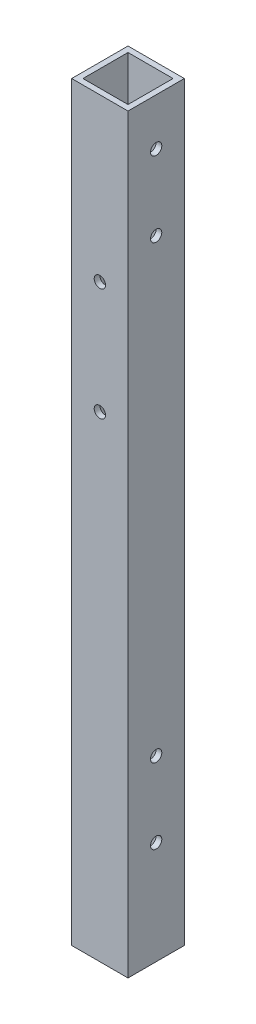
ISO-10303-21;
HEADER;
FILE_DESCRIPTION(('STEP AP214'),'2;1');
FILE_NAME('part.step','',(''),(''),'','','');
FILE_SCHEMA(('AUTOMOTIVE_DESIGN { 1 0 10303 214 1 1 1 1 }'));
ENDSEC;
DATA;
#1=APPLICATION_CONTEXT('core data for automotive mechanical design processes');
#2=APPLICATION_PROTOCOL_DEFINITION('international standard','automotive_design',2000,#1);
#3=PRODUCT_CONTEXT('',#1,'mechanical');
#4=PRODUCT('Part','Part','',(#3));
#5=PRODUCT_RELATED_PRODUCT_CATEGORY('part','',(#4));
#6=PRODUCT_DEFINITION_FORMATION('','',#4);
#7=PRODUCT_DEFINITION_CONTEXT('part definition',#1,'design');
#8=PRODUCT_DEFINITION('design','',#6,#7);
#9=PRODUCT_DEFINITION_SHAPE('','',#8);
#10=(LENGTH_UNIT() NAMED_UNIT(*) SI_UNIT(.MILLI.,.METRE.));
#11=(NAMED_UNIT(*) PLANE_ANGLE_UNIT() SI_UNIT($,.RADIAN.));
#12=(NAMED_UNIT(*) SI_UNIT($,.STERADIAN.) SOLID_ANGLE_UNIT());
#13=UNCERTAINTY_MEASURE_WITH_UNIT(LENGTH_MEASURE(1.E-05),#10,'distance_accuracy_value','');
#14=(GEOMETRIC_REPRESENTATION_CONTEXT(3) GLOBAL_UNCERTAINTY_ASSIGNED_CONTEXT((#13)) GLOBAL_UNIT_ASSIGNED_CONTEXT((#10,
#11,#12)) REPRESENTATION_CONTEXT('',''));
#15=CARTESIAN_POINT('',(0.,0.,0.));
#16=DIRECTION('',(0.,0.,1.));
#17=DIRECTION('',(1.,0.,0.));
#18=AXIS2_PLACEMENT_3D('',#15,#16,#17);
#19=CARTESIAN_POINT('',(0.,200.,0.));
#20=DIRECTION('',(0.,1.,0.));
#21=DIRECTION('',(0.,0.,1.));
#22=AXIS2_PLACEMENT_3D('',#19,#20,#21);
#23=PLANE('',#22);
#24=DIRECTION('',(0.,0.,1.));
#25=VECTOR('',#24,1.);
#26=CARTESIAN_POINT('',(0.,200.,0.));
#27=LINE('',#26,#25);
#28=CARTESIAN_POINT('',(0.,200.,-15.));
#29=VERTEX_POINT('',#28);
#30=CARTESIAN_POINT('',(0.,200.,0.));
#31=VERTEX_POINT('',#30);
#32=EDGE_CURVE('E169',#29,#31,#27,.T.);
#33=ORIENTED_EDGE('',*,*,#32,.T.);
#34=DIRECTION('',(1.,0.,0.));
#35=VECTOR('',#34,1.);
#36=CARTESIAN_POINT('',(0.,200.,0.));
#37=LINE('',#36,#35);
#38=CARTESIAN_POINT('',(15.,200.,0.));
#39=VERTEX_POINT('',#38);
#40=EDGE_CURVE('E172',#31,#39,#37,.T.);
#41=ORIENTED_EDGE('',*,*,#40,.T.);
#42=DIRECTION('',(0.,0.,-1.));
#43=VECTOR('',#42,1.);
#44=CARTESIAN_POINT('',(15.,200.,0.));
#45=LINE('',#44,#43);
#46=CARTESIAN_POINT('',(15.,200.,-15.));
#47=VERTEX_POINT('',#46);
#48=EDGE_CURVE('E175',#39,#47,#45,.T.);
#49=ORIENTED_EDGE('',*,*,#48,.T.);
#50=DIRECTION('',(-1.,0.,0.));
#51=VECTOR('',#50,1.);
#52=CARTESIAN_POINT('',(0.,200.,-15.));
#53=LINE('',#52,#51);
#54=EDGE_CURVE('E177',#47,#29,#53,.T.);
#55=ORIENTED_EDGE('',*,*,#54,.T.);
#56=EDGE_LOOP('',(#33,#41,#49,#55));
#57=FACE_BOUND('',#56,.T.);
#58=DIRECTION('',(1.,0.,0.));
#59=VECTOR('',#58,1.);
#60=CARTESIAN_POINT('',(0.,200.,-1.5));
#61=LINE('',#60,#59);
#62=CARTESIAN_POINT('',(1.5,200.,-1.5));
#63=VERTEX_POINT('',#62);
#64=CARTESIAN_POINT('',(13.5,200.,-1.5));
#65=VERTEX_POINT('',#64);
#66=EDGE_CURVE('E139',#63,#65,#61,.T.);
#67=ORIENTED_EDGE('',*,*,#66,.F.);
#68=DIRECTION('',(0.,0.,1.));
#69=VECTOR('',#68,1.);
#70=CARTESIAN_POINT('',(1.5,200.,0.));
#71=LINE('',#70,#69);
#72=CARTESIAN_POINT('',(1.5,200.,-13.5));
#73=VERTEX_POINT('',#72);
#74=EDGE_CURVE('E131',#73,#63,#71,.T.);
#75=ORIENTED_EDGE('',*,*,#74,.F.);
#76=DIRECTION('',(-1.,0.,0.));
#77=VECTOR('',#76,1.);
#78=CARTESIAN_POINT('',(0.,200.,-13.5));
#79=LINE('',#78,#77);
#80=CARTESIAN_POINT('',(13.5,200.,-13.5));
#81=VERTEX_POINT('',#80);
#82=EDGE_CURVE('E153',#81,#73,#79,.T.);
#83=ORIENTED_EDGE('',*,*,#82,.F.);
#84=DIRECTION('',(0.,0.,-1.));
#85=VECTOR('',#84,1.);
#86=CARTESIAN_POINT('',(13.5,200.,0.));
#87=LINE('',#86,#85);
#88=EDGE_CURVE('E151',#65,#81,#87,.T.);
#89=ORIENTED_EDGE('',*,*,#88,.F.);
#90=EDGE_LOOP('',(#67,#75,#83,#89));
#91=FACE_BOUND('',#90,.T.);
#92=ADVANCED_FACE('F64',(#57,#91),#23,.T.);
#93=CARTESIAN_POINT('',(0.,0.,0.));
#94=DIRECTION('',(0.,1.,0.));
#95=DIRECTION('',(0.,0.,1.));
#96=AXIS2_PLACEMENT_3D('',#93,#94,#95);
#97=PLANE('',#96);
#98=DIRECTION('',(0.,0.,1.));
#99=VECTOR('',#98,1.);
#100=CARTESIAN_POINT('',(0.,0.,0.));
#101=LINE('',#100,#99);
#102=CARTESIAN_POINT('',(0.,0.,-15.));
#103=VERTEX_POINT('',#102);
#104=CARTESIAN_POINT('',(0.,0.,0.));
#105=VERTEX_POINT('',#104);
#106=EDGE_CURVE('E147',#103,#105,#101,.T.);
#107=ORIENTED_EDGE('',*,*,#106,.F.);
#108=DIRECTION('',(-1.,0.,0.));
#109=VECTOR('',#108,1.);
#110=CARTESIAN_POINT('',(0.,0.,-15.));
#111=LINE('',#110,#109);
#112=CARTESIAN_POINT('',(15.,0.,-15.));
#113=VERTEX_POINT('',#112);
#114=EDGE_CURVE('E173',#113,#103,#111,.T.);
#115=ORIENTED_EDGE('',*,*,#114,.F.);
#116=DIRECTION('',(0.,0.,-1.));
#117=VECTOR('',#116,1.);
#118=CARTESIAN_POINT('',(15.,0.,0.));
#119=LINE('',#118,#117);
#120=CARTESIAN_POINT('',(15.,0.,0.));
#121=VERTEX_POINT('',#120);
#122=EDGE_CURVE('E184',#121,#113,#119,.T.);
#123=ORIENTED_EDGE('',*,*,#122,.F.);
#124=DIRECTION('',(1.,0.,0.));
#125=VECTOR('',#124,1.);
#126=CARTESIAN_POINT('',(0.,0.,0.));
#127=LINE('',#126,#125);
#128=EDGE_CURVE('E182',#105,#121,#127,.T.);
#129=ORIENTED_EDGE('',*,*,#128,.F.);
#130=EDGE_LOOP('',(#107,#115,#123,#129));
#131=FACE_BOUND('',#130,.T.);
#132=DIRECTION('',(0.,0.,1.));
#133=VECTOR('',#132,1.);
#134=CARTESIAN_POINT('',(1.5,0.,0.));
#135=LINE('',#134,#133);
#136=CARTESIAN_POINT('',(1.5,0.,-13.5));
#137=VERTEX_POINT('',#136);
#138=CARTESIAN_POINT('',(1.5,0.,-1.5));
#139=VERTEX_POINT('',#138);
#140=EDGE_CURVE('E89',#137,#139,#135,.T.);
#141=ORIENTED_EDGE('',*,*,#140,.T.);
#142=DIRECTION('',(1.,0.,0.));
#143=VECTOR('',#142,1.);
#144=CARTESIAN_POINT('',(0.,0.,-1.5));
#145=LINE('',#144,#143);
#146=CARTESIAN_POINT('',(13.5,0.,-1.5));
#147=VERTEX_POINT('',#146);
#148=EDGE_CURVE('E146',#139,#147,#145,.T.);
#149=ORIENTED_EDGE('',*,*,#148,.T.);
#150=DIRECTION('',(0.,0.,-1.));
#151=VECTOR('',#150,1.);
#152=CARTESIAN_POINT('',(13.5,0.,0.));
#153=LINE('',#152,#151);
#154=CARTESIAN_POINT('',(13.5,0.,-13.5));
#155=VERTEX_POINT('',#154);
#156=EDGE_CURVE('E161',#147,#155,#153,.T.);
#157=ORIENTED_EDGE('',*,*,#156,.T.);
#158=DIRECTION('',(-1.,0.,0.));
#159=VECTOR('',#158,1.);
#160=CARTESIAN_POINT('',(0.,0.,-13.5));
#161=LINE('',#160,#159);
#162=EDGE_CURVE('E140',#155,#137,#161,.T.);
#163=ORIENTED_EDGE('',*,*,#162,.T.);
#164=EDGE_LOOP('',(#141,#149,#157,#163));
#165=FACE_BOUND('',#164,.T.);
#166=ADVANCED_FACE('F290',(#131,#165),#97,.F.);
#167=CARTESIAN_POINT('',(0.,200.,0.));
#168=DIRECTION('',(1.,0.,0.));
#169=DIRECTION('',(0.,0.,-1.));
#170=AXIS2_PLACEMENT_3D('',#167,#168,#169);
#171=PLANE('',#170);
#172=CARTESIAN_POINT('',(0.,187.500000000009,-7.49999999999847));
#173=DIRECTION('',(-1.,0.,0.));
#174=DIRECTION('',(0.,0.,1.));
#175=AXIS2_PLACEMENT_3D('',#172,#173,#174);
#176=CIRCLE('',#175,1.5);
#177=CARTESIAN_POINT('',(0.,187.500000000009,-5.99999999999847));
#178=VERTEX_POINT('',#177);
#179=EDGE_CURVE('E237',#178,#178,#176,.T.);
#180=ORIENTED_EDGE('',*,*,#179,.F.);
#181=EDGE_LOOP('',(#180));
#182=FACE_BOUND('',#181,.T.);
#183=CARTESIAN_POINT('',(0.,167.500000000009,-7.49999999999847));
#184=DIRECTION('',(-1.,0.,0.));
#185=DIRECTION('',(0.,0.,1.));
#186=AXIS2_PLACEMENT_3D('',#183,#184,#185);
#187=CIRCLE('',#186,1.5);
#188=CARTESIAN_POINT('',(0.,167.500000000009,-5.99999999999847));
#189=VERTEX_POINT('',#188);
#190=EDGE_CURVE('E240',#189,#189,#187,.T.);
#191=ORIENTED_EDGE('',*,*,#190,.F.);
#192=EDGE_LOOP('',(#191));
#193=FACE_BOUND('',#192,.T.);
#194=CARTESIAN_POINT('',(0.,47.4999999999999,-7.49999999999949));
#195=DIRECTION('',(-1.,0.,0.));
#196=DIRECTION('',(0.,0.,1.));
#197=AXIS2_PLACEMENT_3D('',#194,#195,#196);
#198=CIRCLE('',#197,1.5);
#199=CARTESIAN_POINT('',(0.,47.4999999999999,-5.99999999999949));
#200=VERTEX_POINT('',#199);
#201=EDGE_CURVE('E246',#200,#200,#198,.T.);
#202=ORIENTED_EDGE('',*,*,#201,.F.);
#203=EDGE_LOOP('',(#202));
#204=FACE_BOUND('',#203,.T.);
#205=CARTESIAN_POINT('',(0.,27.4999999999999,-7.49999999999971));
#206=DIRECTION('',(-1.,0.,0.));
#207=DIRECTION('',(0.,0.,1.));
#208=AXIS2_PLACEMENT_3D('',#205,#206,#207);
#209=CIRCLE('',#208,1.5);
#210=CARTESIAN_POINT('',(0.,27.4999999999999,-5.99999999999971));
#211=VERTEX_POINT('',#210);
#212=EDGE_CURVE('E252',#211,#211,#209,.T.);
#213=ORIENTED_EDGE('',*,*,#212,.F.);
#214=EDGE_LOOP('',(#213));
#215=FACE_BOUND('',#214,.T.);
#216=ORIENTED_EDGE('',*,*,#106,.T.);
#217=DIRECTION('',(0.,-1.,0.));
#218=VECTOR('',#217,1.);
#219=CARTESIAN_POINT('',(0.,200.,0.));
#220=LINE('',#219,#218);
#221=EDGE_CURVE('E12',#31,#105,#220,.T.);
#222=ORIENTED_EDGE('',*,*,#221,.F.);
#223=ORIENTED_EDGE('',*,*,#32,.F.);
#224=DIRECTION('',(0.,-1.,0.));
#225=VECTOR('',#224,1.);
#226=CARTESIAN_POINT('',(0.,200.,-15.));
#227=LINE('',#226,#225);
#228=EDGE_CURVE('E179',#29,#103,#227,.T.);
#229=ORIENTED_EDGE('',*,*,#228,.T.);
#230=EDGE_LOOP('',(#216,#222,#223,#229));
#231=FACE_BOUND('',#230,.T.);
#232=ADVANCED_FACE('F66',(#182,#193,#204,#215,#231),#171,.F.);
#233=CARTESIAN_POINT('',(0.,200.,0.));
#234=DIRECTION('',(0.,0.,-1.));
#235=DIRECTION('',(-1.,0.,0.));
#236=AXIS2_PLACEMENT_3D('',#233,#234,#235);
#237=PLANE('',#236);
#238=CARTESIAN_POINT('',(7.49999999999999,156.842038038062,0.));
#239=DIRECTION('',(0.,0.,-1.));
#240=DIRECTION('',(-1.,0.,0.));
#241=AXIS2_PLACEMENT_3D('',#238,#239,#240);
#242=CIRCLE('',#241,1.5);
#243=CARTESIAN_POINT('',(5.99999999999999,156.842038038062,0.));
#244=VERTEX_POINT('',#243);
#245=EDGE_CURVE('E212',#244,#244,#242,.T.);
#246=ORIENTED_EDGE('',*,*,#245,.T.);
#247=EDGE_LOOP('',(#246));
#248=FACE_BOUND('',#247,.T.);
#249=CARTESIAN_POINT('',(7.49999999999999,126.842038038062,0.));
#250=DIRECTION('',(0.,0.,-1.));
#251=DIRECTION('',(-1.,0.,0.));
#252=AXIS2_PLACEMENT_3D('',#249,#250,#251);
#253=CIRCLE('',#252,1.5);
#254=CARTESIAN_POINT('',(5.99999999999999,126.842038038062,0.));
#255=VERTEX_POINT('',#254);
#256=EDGE_CURVE('E228',#255,#255,#253,.T.);
#257=ORIENTED_EDGE('',*,*,#256,.T.);
#258=EDGE_LOOP('',(#257));
#259=FACE_BOUND('',#258,.T.);
#260=ORIENTED_EDGE('',*,*,#128,.T.);
#261=DIRECTION('',(0.,-1.,0.));
#262=VECTOR('',#261,1.);
#263=CARTESIAN_POINT('',(15.,200.,0.));
#264=LINE('',#263,#262);
#265=EDGE_CURVE('E73',#39,#121,#264,.T.);
#266=ORIENTED_EDGE('',*,*,#265,.F.);
#267=ORIENTED_EDGE('',*,*,#40,.F.);
#268=ORIENTED_EDGE('',*,*,#221,.T.);
#269=EDGE_LOOP('',(#260,#266,#267,#268));
#270=FACE_BOUND('',#269,.T.);
#271=ADVANCED_FACE('F289',(#248,#259,#270),#237,.F.);
#272=CARTESIAN_POINT('',(15.,200.,0.));
#273=DIRECTION('',(-1.,0.,0.));
#274=DIRECTION('',(0.,0.,1.));
#275=AXIS2_PLACEMENT_3D('',#272,#273,#274);
#276=PLANE('',#275);
#277=CARTESIAN_POINT('',(15.,187.500000000009,-7.49999999999847));
#278=DIRECTION('',(-1.,0.,0.));
#279=DIRECTION('',(0.,0.,1.));
#280=AXIS2_PLACEMENT_3D('',#277,#278,#279);
#281=CIRCLE('',#280,1.5);
#282=CARTESIAN_POINT('',(15.,187.500000000009,-5.99999999999847));
#283=VERTEX_POINT('',#282);
#284=EDGE_CURVE('E198',#283,#283,#281,.T.);
#285=ORIENTED_EDGE('',*,*,#284,.T.);
#286=EDGE_LOOP('',(#285));
#287=FACE_BOUND('',#286,.T.);
#288=CARTESIAN_POINT('',(15.,167.500000000009,-7.49999999999847));
#289=DIRECTION('',(-1.,0.,0.));
#290=DIRECTION('',(0.,0.,1.));
#291=AXIS2_PLACEMENT_3D('',#288,#289,#290);
#292=CIRCLE('',#291,1.5);
#293=CARTESIAN_POINT('',(15.,167.500000000009,-5.99999999999847));
#294=VERTEX_POINT('',#293);
#295=EDGE_CURVE('E243',#294,#294,#292,.T.);
#296=ORIENTED_EDGE('',*,*,#295,.T.);
#297=EDGE_LOOP('',(#296));
#298=FACE_BOUND('',#297,.T.);
#299=CARTESIAN_POINT('',(15.,47.4999999999999,-7.49999999999949));
#300=DIRECTION('',(-1.,0.,0.));
#301=DIRECTION('',(0.,0.,1.));
#302=AXIS2_PLACEMENT_3D('',#299,#300,#301);
#303=CIRCLE('',#302,1.5);
#304=CARTESIAN_POINT('',(15.,47.4999999999999,-5.99999999999949));
#305=VERTEX_POINT('',#304);
#306=EDGE_CURVE('E249',#305,#305,#303,.T.);
#307=ORIENTED_EDGE('',*,*,#306,.T.);
#308=EDGE_LOOP('',(#307));
#309=FACE_BOUND('',#308,.T.);
#310=CARTESIAN_POINT('',(15.,27.4999999999999,-7.49999999999971));
#311=DIRECTION('',(-1.,0.,0.));
#312=DIRECTION('',(0.,0.,1.));
#313=AXIS2_PLACEMENT_3D('',#310,#311,#312);
#314=CIRCLE('',#313,1.5);
#315=CARTESIAN_POINT('',(15.,27.4999999999999,-5.99999999999971));
#316=VERTEX_POINT('',#315);
#317=EDGE_CURVE('E234',#316,#316,#314,.T.);
#318=ORIENTED_EDGE('',*,*,#317,.T.);
#319=EDGE_LOOP('',(#318));
#320=FACE_BOUND('',#319,.T.);
#321=ORIENTED_EDGE('',*,*,#122,.T.);
#322=DIRECTION('',(0.,-1.,0.));
#323=VECTOR('',#322,1.);
#324=CARTESIAN_POINT('',(15.,200.,-15.));
#325=LINE('',#324,#323);
#326=EDGE_CURVE('E189',#47,#113,#325,.T.);
#327=ORIENTED_EDGE('',*,*,#326,.F.);
#328=ORIENTED_EDGE('',*,*,#48,.F.);
#329=ORIENTED_EDGE('',*,*,#265,.T.);
#330=EDGE_LOOP('',(#321,#327,#328,#329));
#331=FACE_BOUND('',#330,.T.);
#332=ADVANCED_FACE('F308',(#287,#298,#309,#320,#331),#276,.F.);
#333=CARTESIAN_POINT('',(0.,200.,-15.));
#334=DIRECTION('',(0.,0.,1.));
#335=DIRECTION('',(1.,0.,0.));
#336=AXIS2_PLACEMENT_3D('',#333,#334,#335);
#337=PLANE('',#336);
#338=CARTESIAN_POINT('',(7.49999999999999,156.842038038062,-15.));
#339=DIRECTION('',(0.,0.,-1.));
#340=DIRECTION('',(-1.,0.,0.));
#341=AXIS2_PLACEMENT_3D('',#338,#339,#340);
#342=CIRCLE('',#341,1.5);
#343=CARTESIAN_POINT('',(5.99999999999999,156.842038038062,-15.));
#344=VERTEX_POINT('',#343);
#345=EDGE_CURVE('E218',#344,#344,#342,.T.);
#346=ORIENTED_EDGE('',*,*,#345,.F.);
#347=EDGE_LOOP('',(#346));
#348=FACE_BOUND('',#347,.T.);
#349=CARTESIAN_POINT('',(7.49999999999999,126.842038038062,-15.));
#350=DIRECTION('',(0.,0.,-1.));
#351=DIRECTION('',(-1.,0.,0.));
#352=AXIS2_PLACEMENT_3D('',#349,#350,#351);
#353=CIRCLE('',#352,1.5);
#354=CARTESIAN_POINT('',(5.99999999999999,126.842038038062,-15.));
#355=VERTEX_POINT('',#354);
#356=EDGE_CURVE('E223',#355,#355,#353,.T.);
#357=ORIENTED_EDGE('',*,*,#356,.F.);
#358=EDGE_LOOP('',(#357));
#359=FACE_BOUND('',#358,.T.);
#360=ORIENTED_EDGE('',*,*,#114,.T.);
#361=ORIENTED_EDGE('',*,*,#228,.F.);
#362=ORIENTED_EDGE('',*,*,#54,.F.);
#363=ORIENTED_EDGE('',*,*,#326,.T.);
#364=EDGE_LOOP('',(#360,#361,#362,#363));
#365=FACE_BOUND('',#364,.T.);
#366=ADVANCED_FACE('F270',(#348,#359,#365),#337,.F.);
#367=CARTESIAN_POINT('',(1.5,200.,0.));
#368=DIRECTION('',(1.,0.,0.));
#369=DIRECTION('',(0.,0.,-1.));
#370=AXIS2_PLACEMENT_3D('',#367,#368,#369);
#371=PLANE('',#370);
#372=CARTESIAN_POINT('',(1.5,187.500000000009,-7.49999999999847));
#373=DIRECTION('',(1.,0.,0.));
#374=DIRECTION('',(0.,0.,-1.));
#375=AXIS2_PLACEMENT_3D('',#372,#373,#374);
#376=CIRCLE('',#375,1.5);
#377=CARTESIAN_POINT('',(1.5,187.500000000009,-8.99999999999847));
#378=VERTEX_POINT('',#377);
#379=EDGE_CURVE('E159',#378,#378,#376,.T.);
#380=ORIENTED_EDGE('',*,*,#379,.F.);
#381=EDGE_LOOP('',(#380));
#382=FACE_BOUND('',#381,.T.);
#383=CARTESIAN_POINT('',(1.5,167.500000000009,-7.49999999999847));
#384=DIRECTION('',(1.,0.,0.));
#385=DIRECTION('',(0.,0.,-1.));
#386=AXIS2_PLACEMENT_3D('',#383,#384,#385);
#387=CIRCLE('',#386,1.5);
#388=CARTESIAN_POINT('',(1.5,167.500000000009,-8.99999999999847));
#389=VERTEX_POINT('',#388);
#390=EDGE_CURVE('E206',#389,#389,#387,.T.);
#391=ORIENTED_EDGE('',*,*,#390,.F.);
#392=EDGE_LOOP('',(#391));
#393=FACE_BOUND('',#392,.T.);
#394=CARTESIAN_POINT('',(1.5,47.4999999999999,-7.49999999999949));
#395=DIRECTION('',(1.,0.,0.));
#396=DIRECTION('',(0.,0.,-1.));
#397=AXIS2_PLACEMENT_3D('',#394,#395,#396);
#398=CIRCLE('',#397,1.5);
#399=CARTESIAN_POINT('',(1.5,47.4999999999999,-8.99999999999949));
#400=VERTEX_POINT('',#399);
#401=EDGE_CURVE('E202',#400,#400,#398,.T.);
#402=ORIENTED_EDGE('',*,*,#401,.F.);
#403=EDGE_LOOP('',(#402));
#404=FACE_BOUND('',#403,.T.);
#405=CARTESIAN_POINT('',(1.5,27.4999999999999,-7.49999999999971));
#406=DIRECTION('',(1.,0.,0.));
#407=DIRECTION('',(0.,0.,-1.));
#408=AXIS2_PLACEMENT_3D('',#405,#406,#407);
#409=CIRCLE('',#408,1.5);
#410=CARTESIAN_POINT('',(1.5,27.4999999999999,-8.99999999999971));
#411=VERTEX_POINT('',#410);
#412=EDGE_CURVE('E197',#411,#411,#409,.T.);
#413=ORIENTED_EDGE('',*,*,#412,.F.);
#414=EDGE_LOOP('',(#413));
#415=FACE_BOUND('',#414,.T.);
#416=ORIENTED_EDGE('',*,*,#140,.F.);
#417=DIRECTION('',(0.,-1.,0.));
#418=VECTOR('',#417,1.);
#419=CARTESIAN_POINT('',(1.5,200.,-13.5));
#420=LINE('',#419,#418);
#421=EDGE_CURVE('E135',#73,#137,#420,.T.);
#422=ORIENTED_EDGE('',*,*,#421,.F.);
#423=ORIENTED_EDGE('',*,*,#74,.T.);
#424=DIRECTION('',(0.,-1.,0.));
#425=VECTOR('',#424,1.);
#426=CARTESIAN_POINT('',(1.5,200.,-1.5));
#427=LINE('',#426,#425);
#428=EDGE_CURVE('E134',#63,#139,#427,.T.);
#429=ORIENTED_EDGE('',*,*,#428,.T.);
#430=EDGE_LOOP('',(#416,#422,#423,#429));
#431=FACE_BOUND('',#430,.T.);
#432=ADVANCED_FACE('F133',(#382,#393,#404,#415,#431),#371,.T.);
#433=CARTESIAN_POINT('',(0.,200.,-1.5));
#434=DIRECTION('',(0.,0.,-1.));
#435=DIRECTION('',(-1.,0.,0.));
#436=AXIS2_PLACEMENT_3D('',#433,#434,#435);
#437=PLANE('',#436);
#438=CARTESIAN_POINT('',(7.49999999999999,156.842038038062,-1.5));
#439=DIRECTION('',(0.,0.,-1.));
#440=DIRECTION('',(-1.,0.,0.));
#441=AXIS2_PLACEMENT_3D('',#438,#439,#440);
#442=CIRCLE('',#441,1.5);
#443=CARTESIAN_POINT('',(5.99999999999999,156.842038038062,-1.5));
#444=VERTEX_POINT('',#443);
#445=EDGE_CURVE('E231',#444,#444,#442,.T.);
#446=ORIENTED_EDGE('',*,*,#445,.F.);
#447=EDGE_LOOP('',(#446));
#448=FACE_BOUND('',#447,.T.);
#449=CARTESIAN_POINT('',(7.49999999999999,126.842038038062,-1.5));
#450=DIRECTION('',(0.,0.,-1.));
#451=DIRECTION('',(-1.,0.,0.));
#452=AXIS2_PLACEMENT_3D('',#449,#450,#451);
#453=CIRCLE('',#452,1.5);
#454=CARTESIAN_POINT('',(5.99999999999999,126.842038038062,-1.5));
#455=VERTEX_POINT('',#454);
#456=EDGE_CURVE('E211',#455,#455,#453,.T.);
#457=ORIENTED_EDGE('',*,*,#456,.F.);
#458=EDGE_LOOP('',(#457));
#459=FACE_BOUND('',#458,.T.);
#460=ORIENTED_EDGE('',*,*,#148,.F.);
#461=ORIENTED_EDGE('',*,*,#428,.F.);
#462=ORIENTED_EDGE('',*,*,#66,.T.);
#463=DIRECTION('',(0.,-1.,0.));
#464=VECTOR('',#463,1.);
#465=CARTESIAN_POINT('',(13.5,200.,-1.5));
#466=LINE('',#465,#464);
#467=EDGE_CURVE('E148',#65,#147,#466,.T.);
#468=ORIENTED_EDGE('',*,*,#467,.T.);
#469=EDGE_LOOP('',(#460,#461,#462,#468));
#470=FACE_BOUND('',#469,.T.);
#471=ADVANCED_FACE('F143',(#448,#459,#470),#437,.T.);
#472=CARTESIAN_POINT('',(13.5,200.,0.));
#473=DIRECTION('',(-1.,0.,0.));
#474=DIRECTION('',(0.,0.,1.));
#475=AXIS2_PLACEMENT_3D('',#472,#473,#474);
#476=PLANE('',#475);
#477=CARTESIAN_POINT('',(13.5,187.500000000009,-7.49999999999847));
#478=DIRECTION('',(-1.,0.,0.));
#479=DIRECTION('',(0.,0.,1.));
#480=AXIS2_PLACEMENT_3D('',#477,#478,#479);
#481=CIRCLE('',#480,1.5);
#482=CARTESIAN_POINT('',(13.5,187.500000000009,-5.99999999999847));
#483=VERTEX_POINT('',#482);
#484=EDGE_CURVE('E207',#483,#483,#481,.T.);
#485=ORIENTED_EDGE('',*,*,#484,.F.);
#486=EDGE_LOOP('',(#485));
#487=FACE_BOUND('',#486,.T.);
#488=CARTESIAN_POINT('',(13.5,167.500000000009,-7.49999999999847));
#489=DIRECTION('',(-1.,0.,0.));
#490=DIRECTION('',(0.,0.,1.));
#491=AXIS2_PLACEMENT_3D('',#488,#489,#490);
#492=CIRCLE('',#491,1.5);
#493=CARTESIAN_POINT('',(13.5,167.500000000009,-5.99999999999847));
#494=VERTEX_POINT('',#493);
#495=EDGE_CURVE('E203',#494,#494,#492,.T.);
#496=ORIENTED_EDGE('',*,*,#495,.F.);
#497=EDGE_LOOP('',(#496));
#498=FACE_BOUND('',#497,.T.);
#499=CARTESIAN_POINT('',(13.5,47.4999999999999,-7.49999999999949));
#500=DIRECTION('',(-1.,0.,0.));
#501=DIRECTION('',(0.,0.,1.));
#502=AXIS2_PLACEMENT_3D('',#499,#500,#501);
#503=CIRCLE('',#502,1.5);
#504=CARTESIAN_POINT('',(13.5,47.4999999999999,-5.99999999999949));
#505=VERTEX_POINT('',#504);
#506=EDGE_CURVE('E199',#505,#505,#503,.T.);
#507=ORIENTED_EDGE('',*,*,#506,.F.);
#508=EDGE_LOOP('',(#507));
#509=FACE_BOUND('',#508,.T.);
#510=CARTESIAN_POINT('',(13.5,27.4999999999999,-7.49999999999971));
#511=DIRECTION('',(-1.,0.,0.));
#512=DIRECTION('',(0.,0.,1.));
#513=AXIS2_PLACEMENT_3D('',#510,#511,#512);
#514=CIRCLE('',#513,1.5);
#515=CARTESIAN_POINT('',(13.5,27.4999999999999,-5.99999999999971));
#516=VERTEX_POINT('',#515);
#517=EDGE_CURVE('E194',#516,#516,#514,.T.);
#518=ORIENTED_EDGE('',*,*,#517,.F.);
#519=EDGE_LOOP('',(#518));
#520=FACE_BOUND('',#519,.T.);
#521=ORIENTED_EDGE('',*,*,#156,.F.);
#522=ORIENTED_EDGE('',*,*,#467,.F.);
#523=ORIENTED_EDGE('',*,*,#88,.T.);
#524=DIRECTION('',(0.,-1.,0.));
#525=VECTOR('',#524,1.);
#526=CARTESIAN_POINT('',(13.5,200.,-13.5));
#527=LINE('',#526,#525);
#528=EDGE_CURVE('E81',#81,#155,#527,.T.);
#529=ORIENTED_EDGE('',*,*,#528,.T.);
#530=EDGE_LOOP('',(#521,#522,#523,#529));
#531=FACE_BOUND('',#530,.T.);
#532=ADVANCED_FACE('F328',(#487,#498,#509,#520,#531),#476,.T.);
#533=CARTESIAN_POINT('',(0.,200.,-13.5));
#534=DIRECTION('',(0.,0.,1.));
#535=DIRECTION('',(1.,0.,0.));
#536=AXIS2_PLACEMENT_3D('',#533,#534,#535);
#537=PLANE('',#536);
#538=CARTESIAN_POINT('',(7.49999999999999,156.842038038062,-13.5));
#539=DIRECTION('',(0.,0.,1.));
#540=DIRECTION('',(1.,0.,0.));
#541=AXIS2_PLACEMENT_3D('',#538,#539,#540);
#542=CIRCLE('',#541,1.5);
#543=CARTESIAN_POINT('',(8.99999999999999,156.842038038062,-13.5));
#544=VERTEX_POINT('',#543);
#545=EDGE_CURVE('E68',#544,#544,#542,.T.);
#546=ORIENTED_EDGE('',*,*,#545,.F.);
#547=EDGE_LOOP('',(#546));
#548=FACE_BOUND('',#547,.T.);
#549=CARTESIAN_POINT('',(7.49999999999999,126.842038038062,-13.5));
#550=DIRECTION('',(0.,0.,1.));
#551=DIRECTION('',(1.,0.,0.));
#552=AXIS2_PLACEMENT_3D('',#549,#550,#551);
#553=CIRCLE('',#552,1.5);
#554=CARTESIAN_POINT('',(8.99999999999999,126.842038038062,-13.5));
#555=VERTEX_POINT('',#554);
#556=EDGE_CURVE('E209',#555,#555,#553,.T.);
#557=ORIENTED_EDGE('',*,*,#556,.F.);
#558=EDGE_LOOP('',(#557));
#559=FACE_BOUND('',#558,.T.);
#560=ORIENTED_EDGE('',*,*,#162,.F.);
#561=ORIENTED_EDGE('',*,*,#528,.F.);
#562=ORIENTED_EDGE('',*,*,#82,.T.);
#563=ORIENTED_EDGE('',*,*,#421,.T.);
#564=EDGE_LOOP('',(#560,#561,#562,#563));
#565=FACE_BOUND('',#564,.T.);
#566=ADVANCED_FACE('F332',(#548,#559,#565),#537,.T.);
#567=CARTESIAN_POINT('',(15.,27.4999999999999,-7.49999999999971));
#568=DIRECTION('',(-1.,0.,0.));
#569=DIRECTION('',(0.,0.,1.));
#570=AXIS2_PLACEMENT_3D('',#567,#568,#569);
#571=CYLINDRICAL_SURFACE('',#570,1.5);
#572=ORIENTED_EDGE('',*,*,#517,.T.);
#573=EDGE_LOOP('',(#572));
#574=FACE_BOUND('',#573,.T.);
#575=ORIENTED_EDGE('',*,*,#317,.F.);
#576=EDGE_LOOP('',(#575));
#577=FACE_BOUND('',#576,.T.);
#578=ADVANCED_FACE('F284',(#574,#577),#571,.F.);
#579=CARTESIAN_POINT('',(15.,47.4999999999999,-7.49999999999949));
#580=DIRECTION('',(-1.,0.,0.));
#581=DIRECTION('',(0.,0.,1.));
#582=AXIS2_PLACEMENT_3D('',#579,#580,#581);
#583=CYLINDRICAL_SURFACE('',#582,1.5);
#584=ORIENTED_EDGE('',*,*,#506,.T.);
#585=EDGE_LOOP('',(#584));
#586=FACE_BOUND('',#585,.T.);
#587=ORIENTED_EDGE('',*,*,#306,.F.);
#588=EDGE_LOOP('',(#587));
#589=FACE_BOUND('',#588,.T.);
#590=ADVANCED_FACE('F338',(#586,#589),#583,.F.);
#591=CARTESIAN_POINT('',(15.,167.500000000009,-7.49999999999847));
#592=DIRECTION('',(-1.,0.,0.));
#593=DIRECTION('',(0.,0.,1.));
#594=AXIS2_PLACEMENT_3D('',#591,#592,#593);
#595=CYLINDRICAL_SURFACE('',#594,1.5);
#596=ORIENTED_EDGE('',*,*,#495,.T.);
#597=EDGE_LOOP('',(#596));
#598=FACE_BOUND('',#597,.T.);
#599=ORIENTED_EDGE('',*,*,#295,.F.);
#600=EDGE_LOOP('',(#599));
#601=FACE_BOUND('',#600,.T.);
#602=ADVANCED_FACE('F342',(#598,#601),#595,.F.);
#603=CARTESIAN_POINT('',(15.,187.500000000009,-7.49999999999847));
#604=DIRECTION('',(-1.,0.,0.));
#605=DIRECTION('',(0.,0.,1.));
#606=AXIS2_PLACEMENT_3D('',#603,#604,#605);
#607=CYLINDRICAL_SURFACE('',#606,1.5);
#608=ORIENTED_EDGE('',*,*,#484,.T.);
#609=EDGE_LOOP('',(#608));
#610=FACE_BOUND('',#609,.T.);
#611=ORIENTED_EDGE('',*,*,#284,.F.);
#612=EDGE_LOOP('',(#611));
#613=FACE_BOUND('',#612,.T.);
#614=ADVANCED_FACE('F282',(#610,#613),#607,.F.);
#615=ORIENTED_EDGE('',*,*,#412,.T.);
#616=EDGE_LOOP('',(#615));
#617=FACE_BOUND('',#616,.T.);
#618=ORIENTED_EDGE('',*,*,#212,.T.);
#619=EDGE_LOOP('',(#618));
#620=FACE_BOUND('',#619,.T.);
#621=ADVANCED_FACE('F278',(#617,#620),#571,.F.);
#622=ORIENTED_EDGE('',*,*,#401,.T.);
#623=EDGE_LOOP('',(#622));
#624=FACE_BOUND('',#623,.T.);
#625=ORIENTED_EDGE('',*,*,#201,.T.);
#626=EDGE_LOOP('',(#625));
#627=FACE_BOUND('',#626,.T.);
#628=ADVANCED_FACE('F281',(#624,#627),#583,.F.);
#629=ORIENTED_EDGE('',*,*,#390,.T.);
#630=EDGE_LOOP('',(#629));
#631=FACE_BOUND('',#630,.T.);
#632=ORIENTED_EDGE('',*,*,#190,.T.);
#633=EDGE_LOOP('',(#632));
#634=FACE_BOUND('',#633,.T.);
#635=ADVANCED_FACE('F347',(#631,#634),#595,.F.);
#636=ORIENTED_EDGE('',*,*,#379,.T.);
#637=EDGE_LOOP('',(#636));
#638=FACE_BOUND('',#637,.T.);
#639=ORIENTED_EDGE('',*,*,#179,.T.);
#640=EDGE_LOOP('',(#639));
#641=FACE_BOUND('',#640,.T.);
#642=ADVANCED_FACE('F265',(#638,#641),#607,.F.);
#643=CARTESIAN_POINT('',(7.49999999999999,126.842038038062,0.));
#644=DIRECTION('',(0.,0.,-1.));
#645=DIRECTION('',(-1.,0.,0.));
#646=AXIS2_PLACEMENT_3D('',#643,#644,#645);
#647=CYLINDRICAL_SURFACE('',#646,1.5);
#648=ORIENTED_EDGE('',*,*,#556,.T.);
#649=EDGE_LOOP('',(#648));
#650=FACE_BOUND('',#649,.T.);
#651=ORIENTED_EDGE('',*,*,#356,.T.);
#652=EDGE_LOOP('',(#651));
#653=FACE_BOUND('',#652,.T.);
#654=ADVANCED_FACE('F351',(#650,#653),#647,.F.);
#655=CARTESIAN_POINT('',(7.49999999999999,156.842038038062,0.));
#656=DIRECTION('',(0.,0.,-1.));
#657=DIRECTION('',(-1.,0.,0.));
#658=AXIS2_PLACEMENT_3D('',#655,#656,#657);
#659=CYLINDRICAL_SURFACE('',#658,1.5);
#660=ORIENTED_EDGE('',*,*,#545,.T.);
#661=EDGE_LOOP('',(#660));
#662=FACE_BOUND('',#661,.T.);
#663=ORIENTED_EDGE('',*,*,#345,.T.);
#664=EDGE_LOOP('',(#663));
#665=FACE_BOUND('',#664,.T.);
#666=ADVANCED_FACE('F354',(#662,#665),#659,.F.);
#667=ORIENTED_EDGE('',*,*,#456,.T.);
#668=EDGE_LOOP('',(#667));
#669=FACE_BOUND('',#668,.T.);
#670=ORIENTED_EDGE('',*,*,#256,.F.);
#671=EDGE_LOOP('',(#670));
#672=FACE_BOUND('',#671,.T.);
#673=ADVANCED_FACE('F355',(#669,#672),#647,.F.);
#674=ORIENTED_EDGE('',*,*,#445,.T.);
#675=EDGE_LOOP('',(#674));
#676=FACE_BOUND('',#675,.T.);
#677=ORIENTED_EDGE('',*,*,#245,.F.);
#678=EDGE_LOOP('',(#677));
#679=FACE_BOUND('',#678,.T.);
#680=ADVANCED_FACE('F358',(#676,#679),#659,.F.);
#681=CLOSED_SHELL('',(#92,#166,#232,#271,#332,#366,#432,#471,#532,#566,#578,#590,#602,#614,#621,
#628,#635,#642,#654,#666,#673,#680));
#682=MANIFOLD_SOLID_BREP('B2',#681);
#683=ADVANCED_BREP_SHAPE_REPRESENTATION('',(#18,#682),#14);
#684=SHAPE_DEFINITION_REPRESENTATION(#9,#683);
ENDSEC;
END-ISO-10303-21;
